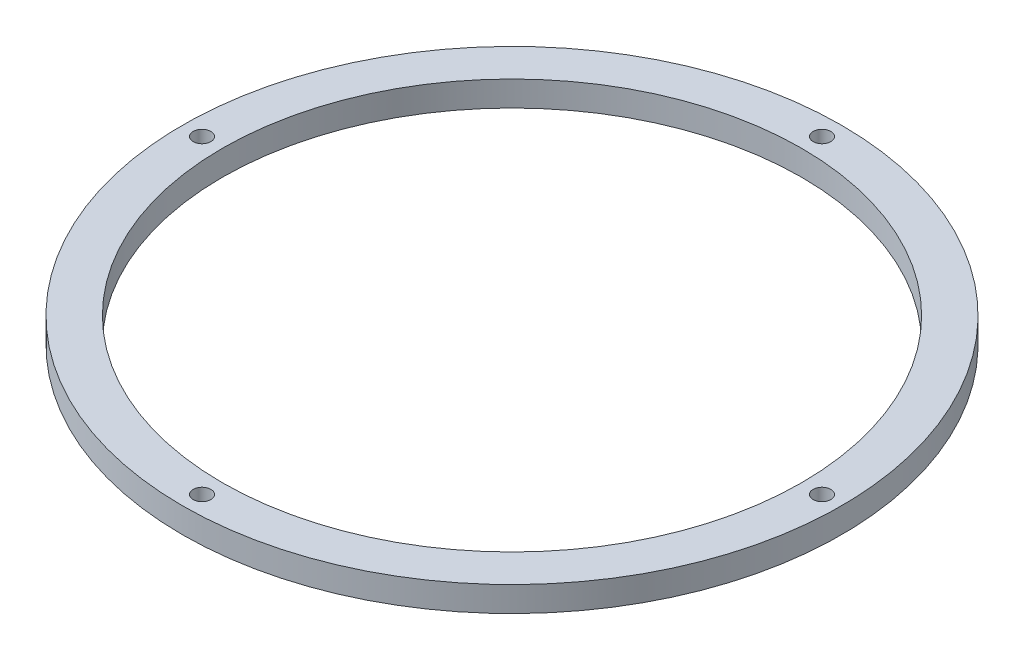
ISO-10303-21;
HEADER;
FILE_DESCRIPTION(('STEP AP214'),'2;1');
FILE_NAME('part.step','',(''),(''),'','','');
FILE_SCHEMA(('AUTOMOTIVE_DESIGN { 1 0 10303 214 1 1 1 1 }'));
ENDSEC;
DATA;
#1=APPLICATION_CONTEXT('core data for automotive mechanical design processes');
#2=APPLICATION_PROTOCOL_DEFINITION('international standard','automotive_design',2000,#1);
#3=PRODUCT_CONTEXT('',#1,'mechanical');
#4=PRODUCT('Part','Part','',(#3));
#5=PRODUCT_RELATED_PRODUCT_CATEGORY('part','',(#4));
#6=PRODUCT_DEFINITION_FORMATION('','',#4);
#7=PRODUCT_DEFINITION_CONTEXT('part definition',#1,'design');
#8=PRODUCT_DEFINITION('design','',#6,#7);
#9=PRODUCT_DEFINITION_SHAPE('','',#8);
#10=(LENGTH_UNIT() NAMED_UNIT(*) SI_UNIT(.MILLI.,.METRE.));
#11=(NAMED_UNIT(*) PLANE_ANGLE_UNIT() SI_UNIT($,.RADIAN.));
#12=(NAMED_UNIT(*) SI_UNIT($,.STERADIAN.) SOLID_ANGLE_UNIT());
#13=UNCERTAINTY_MEASURE_WITH_UNIT(LENGTH_MEASURE(1.E-05),#10,'distance_accuracy_value','');
#14=(GEOMETRIC_REPRESENTATION_CONTEXT(3) GLOBAL_UNCERTAINTY_ASSIGNED_CONTEXT((#13)) GLOBAL_UNIT_ASSIGNED_CONTEXT((#10,
#11,#12)) REPRESENTATION_CONTEXT('',''));
#15=CARTESIAN_POINT('',(0.,0.,0.));
#16=DIRECTION('',(0.,0.,1.));
#17=DIRECTION('',(1.,0.,0.));
#18=AXIS2_PLACEMENT_3D('',#15,#16,#17);
#19=CARTESIAN_POINT('',(0.,8.5,0.));
#20=DIRECTION('',(0.,1.,0.));
#21=DIRECTION('',(0.,0.,1.));
#22=AXIS2_PLACEMENT_3D('',#19,#20,#21);
#23=PLANE('',#22);
#24=CARTESIAN_POINT('',(0.,8.5,-104.875));
#25=DIRECTION('',(0.,1.,0.));
#26=DIRECTION('',(0.,0.,1.));
#27=AXIS2_PLACEMENT_3D('',#24,#25,#26);
#28=CIRCLE('',#27,3.);
#29=CARTESIAN_POINT('',(0.,8.5,-101.875));
#30=VERTEX_POINT('',#29);
#31=EDGE_CURVE('E71',#30,#30,#28,.T.);
#32=ORIENTED_EDGE('',*,*,#31,.F.);
#33=EDGE_LOOP('',(#32));
#34=FACE_BOUND('',#33,.T.);
#35=CARTESIAN_POINT('',(104.875,8.5,0.));
#36=DIRECTION('',(0.,1.,0.));
#37=DIRECTION('',(0.,0.,1.));
#38=AXIS2_PLACEMENT_3D('',#35,#36,#37);
#39=CIRCLE('',#38,3.00000000000001);
#40=CARTESIAN_POINT('',(104.875,8.5,3.00000000000001));
#41=VERTEX_POINT('',#40);
#42=EDGE_CURVE('E69',#41,#41,#39,.T.);
#43=ORIENTED_EDGE('',*,*,#42,.F.);
#44=EDGE_LOOP('',(#43));
#45=FACE_BOUND('',#44,.T.);
#46=CARTESIAN_POINT('',(0.,8.5,104.875));
#47=DIRECTION('',(0.,1.,0.));
#48=DIRECTION('',(0.,0.,1.));
#49=AXIS2_PLACEMENT_3D('',#46,#47,#48);
#50=CIRCLE('',#49,3.);
#51=CARTESIAN_POINT('',(0.,8.5,107.875));
#52=VERTEX_POINT('',#51);
#53=EDGE_CURVE('E63',#52,#52,#50,.T.);
#54=ORIENTED_EDGE('',*,*,#53,.F.);
#55=EDGE_LOOP('',(#54));
#56=FACE_BOUND('',#55,.T.);
#57=CARTESIAN_POINT('',(-104.875,8.5,0.));
#58=DIRECTION('',(0.,1.,0.));
#59=DIRECTION('',(0.,0.,1.));
#60=AXIS2_PLACEMENT_3D('',#57,#58,#59);
#61=CIRCLE('',#60,3.00000000000001);
#62=CARTESIAN_POINT('',(-104.875,8.5,3.00000000000001));
#63=VERTEX_POINT('',#62);
#64=EDGE_CURVE('E59',#63,#63,#61,.T.);
#65=ORIENTED_EDGE('',*,*,#64,.F.);
#66=EDGE_LOOP('',(#65));
#67=FACE_BOUND('',#66,.T.);
#68=CARTESIAN_POINT('',(0.,8.5,0.));
#69=DIRECTION('',(0.,1.,0.));
#70=DIRECTION('',(0.,0.,1.));
#71=AXIS2_PLACEMENT_3D('',#68,#69,#70);
#72=CIRCLE('',#71,111.5);
#73=CARTESIAN_POINT('',(0.,8.5,111.5));
#74=VERTEX_POINT('',#73);
#75=EDGE_CURVE('E10',#74,#74,#72,.T.);
#76=ORIENTED_EDGE('',*,*,#75,.T.);
#77=EDGE_LOOP('',(#76));
#78=FACE_BOUND('',#77,.T.);
#79=CARTESIAN_POINT('',(0.,8.5,0.));
#80=DIRECTION('',(0.,1.,0.));
#81=DIRECTION('',(0.,0.,1.));
#82=AXIS2_PLACEMENT_3D('',#79,#80,#81);
#83=CIRCLE('',#82,98.);
#84=CARTESIAN_POINT('',(0.,8.5,98.));
#85=VERTEX_POINT('',#84);
#86=EDGE_CURVE('E50',#85,#85,#83,.T.);
#87=ORIENTED_EDGE('',*,*,#86,.F.);
#88=EDGE_LOOP('',(#87));
#89=FACE_BOUND('',#88,.T.);
#90=ADVANCED_FACE('F38',(#34,#45,#56,#67,#78,#89),#23,.T.);
#91=CARTESIAN_POINT('',(0.,0.,0.));
#92=DIRECTION('',(0.,1.,0.));
#93=DIRECTION('',(0.,0.,1.));
#94=AXIS2_PLACEMENT_3D('',#91,#92,#93);
#95=PLANE('',#94);
#96=CARTESIAN_POINT('',(0.,0.,-104.875));
#97=DIRECTION('',(0.,1.,0.));
#98=DIRECTION('',(0.,0.,1.));
#99=AXIS2_PLACEMENT_3D('',#96,#97,#98);
#100=CIRCLE('',#99,3.);
#101=CARTESIAN_POINT('',(0.,0.,-101.875));
#102=VERTEX_POINT('',#101);
#103=EDGE_CURVE('E55',#102,#102,#100,.T.);
#104=ORIENTED_EDGE('',*,*,#103,.T.);
#105=EDGE_LOOP('',(#104));
#106=FACE_BOUND('',#105,.T.);
#107=CARTESIAN_POINT('',(104.875,0.,0.));
#108=DIRECTION('',(0.,1.,0.));
#109=DIRECTION('',(0.,0.,1.));
#110=AXIS2_PLACEMENT_3D('',#107,#108,#109);
#111=CIRCLE('',#110,3.00000000000001);
#112=CARTESIAN_POINT('',(104.875,0.,3.00000000000001));
#113=VERTEX_POINT('',#112);
#114=EDGE_CURVE('E70',#113,#113,#111,.T.);
#115=ORIENTED_EDGE('',*,*,#114,.T.);
#116=EDGE_LOOP('',(#115));
#117=FACE_BOUND('',#116,.T.);
#118=CARTESIAN_POINT('',(0.,0.,104.875));
#119=DIRECTION('',(0.,1.,0.));
#120=DIRECTION('',(0.,0.,1.));
#121=AXIS2_PLACEMENT_3D('',#118,#119,#120);
#122=CIRCLE('',#121,3.);
#123=CARTESIAN_POINT('',(0.,0.,107.875));
#124=VERTEX_POINT('',#123);
#125=EDGE_CURVE('E64',#124,#124,#122,.T.);
#126=ORIENTED_EDGE('',*,*,#125,.T.);
#127=EDGE_LOOP('',(#126));
#128=FACE_BOUND('',#127,.T.);
#129=CARTESIAN_POINT('',(-104.875,0.,0.));
#130=DIRECTION('',(0.,1.,0.));
#131=DIRECTION('',(0.,0.,1.));
#132=AXIS2_PLACEMENT_3D('',#129,#130,#131);
#133=CIRCLE('',#132,3.00000000000001);
#134=CARTESIAN_POINT('',(-104.875,0.,3.00000000000001));
#135=VERTEX_POINT('',#134);
#136=EDGE_CURVE('E54',#135,#135,#133,.T.);
#137=ORIENTED_EDGE('',*,*,#136,.T.);
#138=EDGE_LOOP('',(#137));
#139=FACE_BOUND('',#138,.T.);
#140=CARTESIAN_POINT('',(0.,0.,0.));
#141=DIRECTION('',(0.,1.,0.));
#142=DIRECTION('',(0.,0.,1.));
#143=AXIS2_PLACEMENT_3D('',#140,#141,#142);
#144=CIRCLE('',#143,111.5);
#145=CARTESIAN_POINT('',(0.,0.,111.5));
#146=VERTEX_POINT('',#145);
#147=EDGE_CURVE('E37',#146,#146,#144,.T.);
#148=ORIENTED_EDGE('',*,*,#147,.F.);
#149=EDGE_LOOP('',(#148));
#150=FACE_BOUND('',#149,.T.);
#151=CARTESIAN_POINT('',(0.,0.,0.));
#152=DIRECTION('',(0.,1.,0.));
#153=DIRECTION('',(0.,0.,1.));
#154=AXIS2_PLACEMENT_3D('',#151,#152,#153);
#155=CIRCLE('',#154,98.);
#156=CARTESIAN_POINT('',(0.,0.,98.));
#157=VERTEX_POINT('',#156);
#158=EDGE_CURVE('E47',#157,#157,#155,.T.);
#159=ORIENTED_EDGE('',*,*,#158,.T.);
#160=EDGE_LOOP('',(#159));
#161=FACE_BOUND('',#160,.T.);
#162=ADVANCED_FACE('F76',(#106,#117,#128,#139,#150,#161),#95,.F.);
#163=CARTESIAN_POINT('',(0.,8.5,0.));
#164=DIRECTION('',(0.,-1.,0.));
#165=DIRECTION('',(0.,0.,-1.));
#166=AXIS2_PLACEMENT_3D('',#163,#164,#165);
#167=CYLINDRICAL_SURFACE('',#166,111.5);
#168=ORIENTED_EDGE('',*,*,#75,.F.);
#169=EDGE_LOOP('',(#168));
#170=FACE_BOUND('',#169,.T.);
#171=ORIENTED_EDGE('',*,*,#147,.T.);
#172=EDGE_LOOP('',(#171));
#173=FACE_BOUND('',#172,.T.);
#174=ADVANCED_FACE('F36',(#170,#173),#167,.T.);
#175=CARTESIAN_POINT('',(0.,8.5,0.));
#176=DIRECTION('',(0.,-1.,0.));
#177=DIRECTION('',(0.,0.,-1.));
#178=AXIS2_PLACEMENT_3D('',#175,#176,#177);
#179=CYLINDRICAL_SURFACE('',#178,98.);
#180=ORIENTED_EDGE('',*,*,#86,.T.);
#181=EDGE_LOOP('',(#180));
#182=FACE_BOUND('',#181,.T.);
#183=ORIENTED_EDGE('',*,*,#158,.F.);
#184=EDGE_LOOP('',(#183));
#185=FACE_BOUND('',#184,.T.);
#186=ADVANCED_FACE('F99',(#182,#185),#179,.F.);
#187=CARTESIAN_POINT('',(-104.875,0.,0.));
#188=DIRECTION('',(0.,1.,0.));
#189=DIRECTION('',(0.,0.,1.));
#190=AXIS2_PLACEMENT_3D('',#187,#188,#189);
#191=CYLINDRICAL_SURFACE('',#190,3.00000000000001);
#192=ORIENTED_EDGE('',*,*,#136,.F.);
#193=EDGE_LOOP('',(#192));
#194=FACE_BOUND('',#193,.T.);
#195=ORIENTED_EDGE('',*,*,#64,.T.);
#196=EDGE_LOOP('',(#195));
#197=FACE_BOUND('',#196,.T.);
#198=ADVANCED_FACE('F103',(#194,#197),#191,.F.);
#199=CARTESIAN_POINT('',(0.,0.,104.875));
#200=DIRECTION('',(0.,1.,0.));
#201=DIRECTION('',(0.,0.,1.));
#202=AXIS2_PLACEMENT_3D('',#199,#200,#201);
#203=CYLINDRICAL_SURFACE('',#202,3.);
#204=ORIENTED_EDGE('',*,*,#125,.F.);
#205=EDGE_LOOP('',(#204));
#206=FACE_BOUND('',#205,.T.);
#207=ORIENTED_EDGE('',*,*,#53,.T.);
#208=EDGE_LOOP('',(#207));
#209=FACE_BOUND('',#208,.T.);
#210=ADVANCED_FACE('F113',(#206,#209),#203,.F.);
#211=CARTESIAN_POINT('',(104.875,0.,0.));
#212=DIRECTION('',(0.,1.,0.));
#213=DIRECTION('',(0.,0.,1.));
#214=AXIS2_PLACEMENT_3D('',#211,#212,#213);
#215=CYLINDRICAL_SURFACE('',#214,3.00000000000001);
#216=ORIENTED_EDGE('',*,*,#114,.F.);
#217=EDGE_LOOP('',(#216));
#218=FACE_BOUND('',#217,.T.);
#219=ORIENTED_EDGE('',*,*,#42,.T.);
#220=EDGE_LOOP('',(#219));
#221=FACE_BOUND('',#220,.T.);
#222=ADVANCED_FACE('F81',(#218,#221),#215,.F.);
#223=CARTESIAN_POINT('',(0.,0.,-104.875));
#224=DIRECTION('',(0.,1.,0.));
#225=DIRECTION('',(0.,0.,1.));
#226=AXIS2_PLACEMENT_3D('',#223,#224,#225);
#227=CYLINDRICAL_SURFACE('',#226,3.);
#228=ORIENTED_EDGE('',*,*,#103,.F.);
#229=EDGE_LOOP('',(#228));
#230=FACE_BOUND('',#229,.T.);
#231=ORIENTED_EDGE('',*,*,#31,.T.);
#232=EDGE_LOOP('',(#231));
#233=FACE_BOUND('',#232,.T.);
#234=ADVANCED_FACE('F85',(#230,#233),#227,.F.);
#235=CLOSED_SHELL('',(#90,#162,#174,#186,#198,#210,#222,#234));
#236=MANIFOLD_SOLID_BREP('B2',#235);
#237=ADVANCED_BREP_SHAPE_REPRESENTATION('',(#18,#236),#14);
#238=SHAPE_DEFINITION_REPRESENTATION(#9,#237);
ENDSEC;
END-ISO-10303-21;
